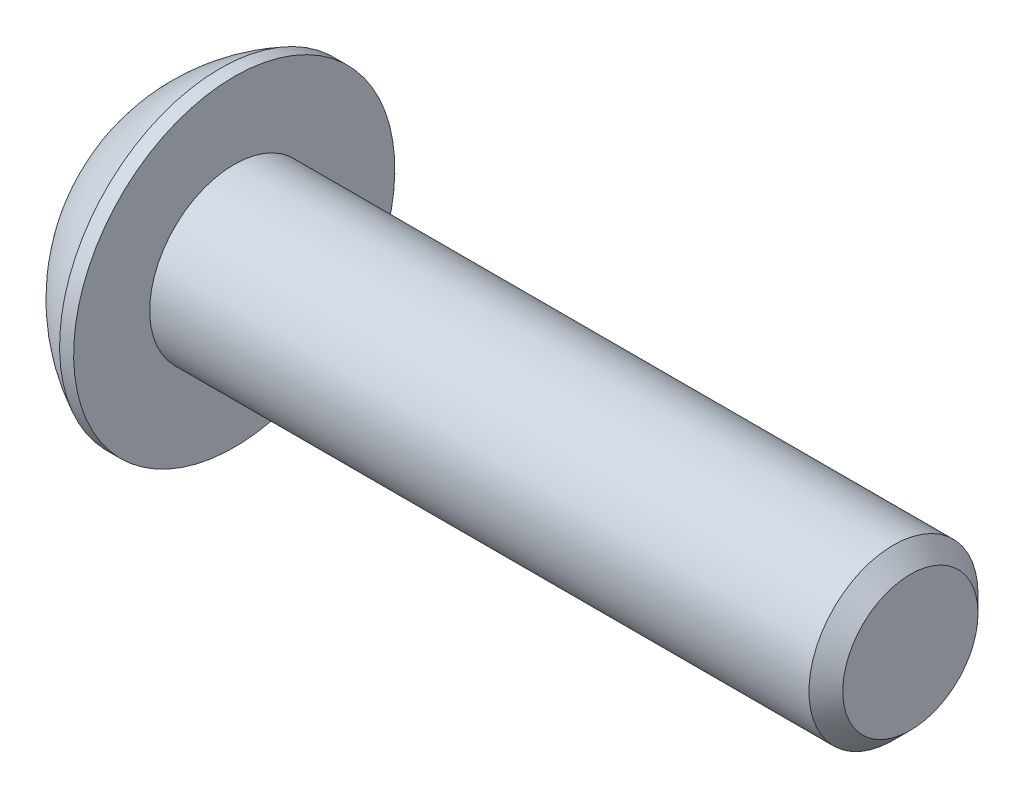
ISO-10303-21;
HEADER;
FILE_DESCRIPTION(('STEP AP214'),'2;1');
FILE_NAME('part.step','',(''),(''),'','','');
FILE_SCHEMA(('AUTOMOTIVE_DESIGN { 1 0 10303 214 1 1 1 1 }'));
ENDSEC;
DATA;
#1=APPLICATION_CONTEXT('core data for automotive mechanical design processes');
#2=APPLICATION_PROTOCOL_DEFINITION('international standard','automotive_design',2000,#1);
#3=PRODUCT_CONTEXT('',#1,'mechanical');
#4=PRODUCT('Part','Part','',(#3));
#5=PRODUCT_RELATED_PRODUCT_CATEGORY('part','',(#4));
#6=PRODUCT_DEFINITION_FORMATION('','',#4);
#7=PRODUCT_DEFINITION_CONTEXT('part definition',#1,'design');
#8=PRODUCT_DEFINITION('design','',#6,#7);
#9=PRODUCT_DEFINITION_SHAPE('','',#8);
#10=(LENGTH_UNIT() NAMED_UNIT(*) SI_UNIT(.MILLI.,.METRE.));
#11=(NAMED_UNIT(*) PLANE_ANGLE_UNIT() SI_UNIT($,.RADIAN.));
#12=(NAMED_UNIT(*) SI_UNIT($,.STERADIAN.) SOLID_ANGLE_UNIT());
#13=UNCERTAINTY_MEASURE_WITH_UNIT(LENGTH_MEASURE(1.E-05),#10,'distance_accuracy_value','');
#14=(GEOMETRIC_REPRESENTATION_CONTEXT(3) GLOBAL_UNCERTAINTY_ASSIGNED_CONTEXT((#13)) GLOBAL_UNIT_ASSIGNED_CONTEXT((#10,
#11,#12)) REPRESENTATION_CONTEXT('',''));
#15=CARTESIAN_POINT('',(0.,0.,0.));
#16=DIRECTION('',(0.,0.,1.));
#17=DIRECTION('',(1.,0.,0.));
#18=AXIS2_PLACEMENT_3D('',#15,#16,#17);
#19=CARTESIAN_POINT('',(-12.,0.,0.));
#20=DIRECTION('',(1.,0.,0.));
#21=DIRECTION('',(0.,0.,-1.));
#22=AXIS2_PLACEMENT_3D('',#19,#20,#21);
#23=CYLINDRICAL_SURFACE('',#22,1.5);
#24=CARTESIAN_POINT('',(-0.300000000000002,0.,0.));
#25=DIRECTION('',(1.,0.,0.));
#26=DIRECTION('',(0.,0.,-1.));
#27=AXIS2_PLACEMENT_3D('',#24,#25,#26);
#28=CIRCLE('',#27,1.5);
#29=CARTESIAN_POINT('',(-0.300000000000002,0.,-1.5));
#30=VERTEX_POINT('',#29);
#31=EDGE_CURVE('E45',#30,#30,#28,.F.);
#32=ORIENTED_EDGE('',*,*,#31,.T.);
#33=EDGE_LOOP('',(#32));
#34=FACE_BOUND('',#33,.T.);
#35=CARTESIAN_POINT('',(-12.,0.,0.));
#36=DIRECTION('',(1.,0.,0.));
#37=DIRECTION('',(0.,1.,0.));
#38=AXIS2_PLACEMENT_3D('',#35,#36,#37);
#39=CIRCLE('',#38,1.5);
#40=CARTESIAN_POINT('',(-12.,1.49999999999999,0.));
#41=VERTEX_POINT('',#40);
#42=EDGE_CURVE('E124',#41,#41,#39,.F.);
#43=ORIENTED_EDGE('',*,*,#42,.F.);
#44=EDGE_LOOP('',(#43));
#45=FACE_BOUND('',#44,.T.);
#46=ADVANCED_FACE('F32',(#34,#45),#23,.T.);
#47=CARTESIAN_POINT('',(0.,0.,0.));
#48=DIRECTION('',(1.,0.,0.));
#49=DIRECTION('',(0.,0.,-1.));
#50=AXIS2_PLACEMENT_3D('',#47,#48,#49);
#51=PLANE('',#50);
#52=CARTESIAN_POINT('',(0.,0.,0.));
#53=DIRECTION('',(1.,0.,0.));
#54=DIRECTION('',(0.,0.,-1.));
#55=AXIS2_PLACEMENT_3D('',#52,#53,#54);
#56=CIRCLE('',#55,1.2);
#57=CARTESIAN_POINT('',(0.,0.,-1.2));
#58=VERTEX_POINT('',#57);
#59=EDGE_CURVE('E127',#58,#58,#56,.T.);
#60=ORIENTED_EDGE('',*,*,#59,.T.);
#61=EDGE_LOOP('',(#60));
#62=FACE_BOUND('',#61,.T.);
#63=ADVANCED_FACE('F137',(#62),#51,.T.);
#64=CARTESIAN_POINT('',(0.,0.,0.));
#65=DIRECTION('',(-1.,0.,0.));
#66=DIRECTION('',(0.,0.,1.));
#67=AXIS2_PLACEMENT_3D('',#64,#65,#66);
#68=CONICAL_SURFACE('',#67,1.2,0.785398163397447);
#69=ORIENTED_EDGE('',*,*,#31,.F.);
#70=EDGE_LOOP('',(#69));
#71=FACE_BOUND('',#70,.T.);
#72=ORIENTED_EDGE('',*,*,#59,.F.);
#73=EDGE_LOOP('',(#72));
#74=FACE_BOUND('',#73,.T.);
#75=ADVANCED_FACE('F34',(#71,#74),#68,.T.);
#76=CARTESIAN_POINT('',(-13.65,0.,0.));
#77=DIRECTION('',(-1.,0.,0.));
#78=DIRECTION('',(0.,-1.,0.));
#79=AXIS2_PLACEMENT_3D('',#76,#77,#78);
#80=PLANE('',#79);
#81=CARTESIAN_POINT('',(-13.65,0.,0.));
#82=DIRECTION('',(-1.,0.,0.));
#83=DIRECTION('',(0.,-1.,0.));
#84=AXIS2_PLACEMENT_3D('',#81,#82,#83);
#85=CIRCLE('',#84,1.20470053837925);
#86=CARTESIAN_POINT('',(-13.65,-1.20470053837926,0.));
#87=VERTEX_POINT('',#86);
#88=EDGE_CURVE('E241',#87,#87,#85,.T.);
#89=ORIENTED_EDGE('',*,*,#88,.F.);
#90=EDGE_LOOP('',(#89));
#91=FACE_BOUND('',#90,.T.);
#92=CARTESIAN_POINT('',(-13.65,0.,0.));
#93=DIRECTION('',(1.,0.,0.));
#94=DIRECTION('',(0.,1.,0.));
#95=AXIS2_PLACEMENT_3D('',#92,#93,#94);
#96=CIRCLE('',#95,1.5);
#97=CARTESIAN_POINT('',(-13.65,1.5,0.));
#98=VERTEX_POINT('',#97);
#99=EDGE_CURVE('E121',#98,#98,#96,.T.);
#100=ORIENTED_EDGE('',*,*,#99,.F.);
#101=EDGE_LOOP('',(#100));
#102=FACE_BOUND('',#101,.T.);
#103=ADVANCED_FACE('F136',(#91,#102),#80,.T.);
#104=CARTESIAN_POINT('',(-10.8526785714286,0.,0.));
#105=DIRECTION('',(1.,0.,0.));
#106=DIRECTION('',(0.,1.,0.));
#107=AXIS2_PLACEMENT_3D('',#104,#105,#106);
#108=SPHERICAL_SURFACE('',#107,3.17411517981703);
#109=ORIENTED_EDGE('',*,*,#99,.T.);
#110=EDGE_LOOP('',(#109));
#111=FACE_BOUND('',#110,.T.);
#112=CARTESIAN_POINT('',(-12.25,0.,0.));
#113=DIRECTION('',(1.,0.,0.));
#114=DIRECTION('',(0.,1.,0.));
#115=AXIS2_PLACEMENT_3D('',#112,#113,#114);
#116=CIRCLE('',#115,2.85);
#117=CARTESIAN_POINT('',(-12.25,2.85,0.));
#118=VERTEX_POINT('',#117);
#119=EDGE_CURVE('E118',#118,#118,#116,.T.);
#120=ORIENTED_EDGE('',*,*,#119,.F.);
#121=EDGE_LOOP('',(#120));
#122=FACE_BOUND('',#121,.T.);
#123=ADVANCED_FACE('F148',(#111,#122),#108,.T.);
#124=CARTESIAN_POINT('',(-12.,0.,0.));
#125=DIRECTION('',(1.,0.,0.));
#126=DIRECTION('',(0.,1.,0.));
#127=AXIS2_PLACEMENT_3D('',#124,#125,#126);
#128=CYLINDRICAL_SURFACE('',#127,2.85);
#129=ORIENTED_EDGE('',*,*,#119,.T.);
#130=EDGE_LOOP('',(#129));
#131=FACE_BOUND('',#130,.T.);
#132=CARTESIAN_POINT('',(-12.,0.,0.));
#133=DIRECTION('',(1.,0.,0.));
#134=DIRECTION('',(0.,1.,0.));
#135=AXIS2_PLACEMENT_3D('',#132,#133,#134);
#136=CIRCLE('',#135,2.85);
#137=CARTESIAN_POINT('',(-12.,2.85,0.));
#138=VERTEX_POINT('',#137);
#139=EDGE_CURVE('E115',#138,#138,#136,.T.);
#140=ORIENTED_EDGE('',*,*,#139,.F.);
#141=EDGE_LOOP('',(#140));
#142=FACE_BOUND('',#141,.T.);
#143=ADVANCED_FACE('F152',(#131,#142),#128,.T.);
#144=CARTESIAN_POINT('',(-12.,2.85,0.));
#145=DIRECTION('',(1.,0.,0.));
#146=DIRECTION('',(0.,1.,0.));
#147=AXIS2_PLACEMENT_3D('',#144,#145,#146);
#148=PLANE('',#147);
#149=ORIENTED_EDGE('',*,*,#42,.T.);
#150=EDGE_LOOP('',(#149));
#151=FACE_BOUND('',#150,.T.);
#152=ORIENTED_EDGE('',*,*,#139,.T.);
#153=EDGE_LOOP('',(#152));
#154=FACE_BOUND('',#153,.T.);
#155=ADVANCED_FACE('F156',(#151,#154),#148,.T.);
#156=CARTESIAN_POINT('',(-13.65,0.,0.));
#157=DIRECTION('',(-1.,0.,0.));
#158=DIRECTION('',(0.,-1.,0.));
#159=AXIS2_PLACEMENT_3D('',#156,#157,#158);
#160=CONICAL_SURFACE('',#159,1.20470053837925,0.78539816339745);
#161=ORIENTED_EDGE('',*,*,#88,.T.);
#162=EDGE_LOOP('',(#161));
#163=FACE_BOUND('',#162,.T.);
#164=CARTESIAN_POINT('',(-14.0125645579163,-1.20678079288097,1.));
#165=CARTESIAN_POINT('',(-13.9901238799752,-1.17763239380938,1.));
#166=CARTESIAN_POINT('',(-13.9678867609271,-1.14832777655039,1.));
#167=CARTESIAN_POINT('',(-13.9239053230859,-1.08934073997341,1.));
#168=CARTESIAN_POINT('',(-13.902161120887,-1.05965823380996,1.));
#169=CARTESIAN_POINT('',(-13.8374858802222,-0.969511619364386,1.));
#170=CARTESIAN_POINT('',(-13.795456442765,-0.908390032886416,1.));
#171=CARTESIAN_POINT('',(-13.7124203349119,-0.77984989921404,1.));
#172=CARTESIAN_POINT('',(-13.6716484956871,-0.712278047733967,1.));
#173=CARTESIAN_POINT('',(-13.5967056855402,-0.573692441836185,1.));
#174=CARTESIAN_POINT('',(-13.5625124208036,-0.502691370033597,1.));
#175=CARTESIAN_POINT('',(-13.5206648240494,-0.396633108483675,1.));
#176=CARTESIAN_POINT('',(-13.5087524246011,-0.363265114723103,1.));
#177=CARTESIAN_POINT('',(-13.4876010580815,-0.295675144863699,1.));
#178=CARTESIAN_POINT('',(-13.4783622608543,-0.261453114661039,1.));
#179=CARTESIAN_POINT('',(-13.4632108375931,-0.192964714439433,1.));
#180=CARTESIAN_POINT('',(-13.4572372079353,-0.158712062702438,1.));
#181=CARTESIAN_POINT('',(-13.4487381792859,-0.0897678989597951,1.));
#182=CARTESIAN_POINT('',(-13.4462131691607,-0.0550763379077967,1.));
#183=CARTESIAN_POINT('',(-13.4448308242394,0.0128534343371955,1.));
#184=CARTESIAN_POINT('',(-13.4458171333425,0.0460884918414608,1.));
#185=CARTESIAN_POINT('',(-13.4510428296463,0.112288777523348,1.));
#186=CARTESIAN_POINT('',(-13.4552814228284,0.145254069576921,1.));
#187=CARTESIAN_POINT('',(-13.4668431932388,0.211252641710467,1.));
#188=CARTESIAN_POINT('',(-13.4742213991969,0.24427612610641,1.));
#189=CARTESIAN_POINT('',(-13.4916537633013,0.3095934161789,1.));
#190=CARTESIAN_POINT('',(-13.5017077720937,0.34188726247213,1.));
#191=CARTESIAN_POINT('',(-13.5364692676108,0.441188556116708,1.));
#192=CARTESIAN_POINT('',(-13.5650343603337,0.50684148084348,1.));
#193=CARTESIAN_POINT('',(-13.6286033694253,0.635081389212367,1.));
#194=CARTESIAN_POINT('',(-13.663629955309,0.697656564069526,1.));
#195=CARTESIAN_POINT('',(-13.7359546107891,0.817274369694615,1.));
#196=CARTESIAN_POINT('',(-13.7730556162911,0.874437672313584,1.));
#197=CARTESIAN_POINT('',(-13.8304371678966,0.958655710303487,1.));
#198=CARTESIAN_POINT('',(-13.8497720189249,0.986366163766953,1.));
#199=CARTESIAN_POINT('',(-13.8889602713879,1.04140691974409,1.));
#200=CARTESIAN_POINT('',(-13.908813529201,1.06873732439881,1.));
#201=CARTESIAN_POINT('',(-13.92888195229,1.0959092145887,1.));
#202=B_SPLINE_CURVE_WITH_KNOTS('',3,(#164,#165,#166,#167,#168,#169,#170,#171,#172,#173,#174,
#175,#176,#177,#178,#179,#180,#181,#182,#183,#184,#185,#186,#187,#188,#189,#190,#191,#192,#193,
#194,#195,#196,#197,#198,#199,#200,#201),.UNSPECIFIED.,.F.,.F.,(4,2,2,2,2,2,2,2,2,2,2,2,2,2,2,2,
2,2,4),(0.,0.110355487284534,0.220736811203826,0.443178348562911,0.679759335181117,
0.915523888816462,1.02172703810024,1.1279369325962,1.23208803653002,1.33625088357217,
1.43583459192535,1.53539399546241,1.63677534642524,1.73815103982916,1.95232008261278,
2.16725532249797,2.37159620059983,2.47295962852456,2.57429526618464),.UNSPECIFIED.);
#203=CARTESIAN_POINT('',(-13.6,-0.577350269189637,1.));
#204=VERTEX_POINT('',#203);
#205=CARTESIAN_POINT('',(-13.6,0.577350269189616,1.));
#206=VERTEX_POINT('',#205);
#207=EDGE_CURVE('E99',#204,#206,#202,.T.);
#208=ORIENTED_EDGE('',*,*,#207,.F.);
#209=CARTESIAN_POINT('',(-13.6001154873726,-1.1548160084331,-0.000200000000000086));
#210=CARTESIAN_POINT('',(-13.5802779308257,-1.13496520795027,0.0341825950071807));
#211=CARTESIAN_POINT('',(-13.5616050206389,-1.11478247255943,0.0691401181398248));
#212=CARTESIAN_POINT('',(-13.5274147427232,-1.0736273952922,0.140422802956089));
#213=CARTESIAN_POINT('',(-13.5119164090235,-1.05265113558081,0.176754750528984));
#214=CARTESIAN_POINT('',(-13.4853673071423,-1.01035337909804,0.250016613803311));
#215=CARTESIAN_POINT('',(-13.4742497739969,-0.989042666109251,0.286927851445414));
#216=CARTESIAN_POINT('',(-13.4571198657762,-0.945952199282702,0.361562729310858));
#217=CARTESIAN_POINT('',(-13.4510946974667,-0.924173762626608,0.399284088108635));
#218=CARTESIAN_POINT('',(-13.4456605549675,-0.886641312640026,0.464292198417932));
#219=CARTESIAN_POINT('',(-13.4448569383167,-0.870936130672287,0.491494371528171));
#220=CARTESIAN_POINT('',(-13.4462066994169,-0.83955617986286,0.545846040669111));
#221=CARTESIAN_POINT('',(-13.4483607295472,-0.823881418494935,0.572995523754874));
#222=CARTESIAN_POINT('',(-13.4591169721285,-0.777080970599378,0.654056277326959));
#223=CARTESIAN_POINT('',(-13.4720145564154,-0.746188191116442,0.707564140978426));
#224=CARTESIAN_POINT('',(-13.5031407306022,-0.691968116419661,0.80147606514343));
#225=CARTESIAN_POINT('',(-13.5197377977018,-0.668386557293383,0.842320523671833));
#226=CARTESIAN_POINT('',(-13.5571249246853,-0.622147085933693,0.922409637381943));
#227=CARTESIAN_POINT('',(-13.5779013418174,-0.599486449584586,0.961659010870437));
#228=CARTESIAN_POINT('',(-13.6001154873726,-0.577234799135799,1.0002));
#229=B_SPLINE_CURVE_WITH_KNOTS('',3,(#209,#210,#211,#212,#213,#214,#215,#216,#217,#218,#219,
#220,#221,#222,#223,#224,#225,#226,#227,#228),.UNSPECIFIED.,.F.,.F.,(4,2,2,2,2,2,2,2,2,4),(0.,
0.133237676828559,0.26725222983449,0.3991370762693,0.530689603280767,0.624814864263845,
0.718960890149131,0.907306626112096,1.05710100361789,1.20641411519286),.UNSPECIFIED.);
#230=CARTESIAN_POINT('',(-13.6,-1.15470053837926,0.));
#231=VERTEX_POINT('',#230);
#232=EDGE_CURVE('E198',#231,#204,#229,.T.);
#233=ORIENTED_EDGE('',*,*,#232,.F.);
#234=CARTESIAN_POINT('',(-13.6001154873726,-0.577234799135799,-1.0002));
#235=CARTESIAN_POINT('',(-13.5802779308257,-0.597085599618632,-0.965817404992819));
#236=CARTESIAN_POINT('',(-13.5616050206389,-0.617268335009467,-0.930859881860175));
#237=CARTESIAN_POINT('',(-13.5274147427232,-0.658423412276697,-0.85957719704391));
#238=CARTESIAN_POINT('',(-13.5119164090235,-0.679399671988091,-0.823245249471016));
#239=CARTESIAN_POINT('',(-13.4853673071423,-0.721697428470857,-0.749983386196689));
#240=CARTESIAN_POINT('',(-13.4742497739969,-0.743008141459647,-0.713072148554586));
#241=CARTESIAN_POINT('',(-13.4571198657762,-0.786098608286197,-0.638437270689141));
#242=CARTESIAN_POINT('',(-13.4510946974667,-0.807877044942291,-0.600715911891365));
#243=CARTESIAN_POINT('',(-13.4456605549675,-0.845409494928873,-0.535707801582067));
#244=CARTESIAN_POINT('',(-13.4448569383167,-0.861114676896612,-0.508505628471829));
#245=CARTESIAN_POINT('',(-13.4462066994169,-0.892494627706039,-0.454153959330889));
#246=CARTESIAN_POINT('',(-13.4483607295472,-0.908169389073964,-0.427004476245125));
#247=CARTESIAN_POINT('',(-13.4591169721285,-0.954969836969521,-0.345943722673041));
#248=CARTESIAN_POINT('',(-13.4720145564154,-0.985862616452458,-0.292435859021573));
#249=CARTESIAN_POINT('',(-13.5031407306022,-1.04008269114924,-0.198523934856569));
#250=CARTESIAN_POINT('',(-13.5197377977018,-1.06366425027552,-0.157679476328167));
#251=CARTESIAN_POINT('',(-13.5571249246853,-1.10990372163521,-0.0775903626180571));
#252=CARTESIAN_POINT('',(-13.5779013418174,-1.13256435798431,-0.0383409891295628));
#253=CARTESIAN_POINT('',(-13.6001154873726,-1.1548160084331,0.00019999999999995));
#254=B_SPLINE_CURVE_WITH_KNOTS('',3,(#234,#235,#236,#237,#238,#239,#240,#241,#242,#243,#244,
#245,#246,#247,#248,#249,#250,#251,#252,#253),.UNSPECIFIED.,.F.,.F.,(4,2,2,2,2,2,2,2,2,4),(0.,
0.133237676828559,0.26725222983449,0.3991370762693,0.530689603280767,0.624814864263845,
0.718960890149132,0.907306626112096,1.05710100361789,1.20641411519286),.UNSPECIFIED.);
#255=CARTESIAN_POINT('',(-13.6,-0.577350269189637,-1.));
#256=VERTEX_POINT('',#255);
#257=EDGE_CURVE('E193',#256,#231,#254,.T.);
#258=ORIENTED_EDGE('',*,*,#257,.F.);
#259=CARTESIAN_POINT('',(-14.0125645579163,-1.20678079288097,-1.));
#260=CARTESIAN_POINT('',(-13.9901238799752,-1.17763239380938,-1.));
#261=CARTESIAN_POINT('',(-13.9678867609271,-1.14832777655039,-1.));
#262=CARTESIAN_POINT('',(-13.9239053230859,-1.08934073997341,-1.));
#263=CARTESIAN_POINT('',(-13.902161120887,-1.05965823380996,-1.));
#264=CARTESIAN_POINT('',(-13.8374858802222,-0.969511619364386,-1.));
#265=CARTESIAN_POINT('',(-13.795456442765,-0.908390032886415,-1.));
#266=CARTESIAN_POINT('',(-13.7124203349119,-0.77984989921404,-1.));
#267=CARTESIAN_POINT('',(-13.6716484956871,-0.712278047733968,-1.));
#268=CARTESIAN_POINT('',(-13.5967056855402,-0.573692441836185,-1.));
#269=CARTESIAN_POINT('',(-13.5625124208036,-0.502691370033597,-1.));
#270=CARTESIAN_POINT('',(-13.5206648240494,-0.396633108483675,-1.));
#271=CARTESIAN_POINT('',(-13.5087524246011,-0.363265114723103,-1.));
#272=CARTESIAN_POINT('',(-13.4876010580815,-0.2956751448637,-1.));
#273=CARTESIAN_POINT('',(-13.4783622608543,-0.261453114661039,-1.));
#274=CARTESIAN_POINT('',(-13.4632108375931,-0.192964714439433,-1.));
#275=CARTESIAN_POINT('',(-13.4572372079353,-0.158712062702438,-1.));
#276=CARTESIAN_POINT('',(-13.4487381792859,-0.0897678989597955,-1.));
#277=CARTESIAN_POINT('',(-13.4462131691607,-0.0550763379077972,-1.));
#278=CARTESIAN_POINT('',(-13.4448308242394,0.012853434337195,-1.));
#279=CARTESIAN_POINT('',(-13.4458171333425,0.0460884918414604,-1.));
#280=CARTESIAN_POINT('',(-13.4510428296463,0.112288777523348,-1.));
#281=CARTESIAN_POINT('',(-13.4552814228284,0.145254069576921,-1.));
#282=CARTESIAN_POINT('',(-13.4668431932388,0.211252641710467,-1.));
#283=CARTESIAN_POINT('',(-13.4742213991969,0.244276126106411,-1.));
#284=CARTESIAN_POINT('',(-13.4916537633013,0.3095934161789,-1.));
#285=CARTESIAN_POINT('',(-13.5017077720937,0.34188726247213,-1.));
#286=CARTESIAN_POINT('',(-13.5364692676108,0.441188556116708,-1.));
#287=CARTESIAN_POINT('',(-13.5650343603337,0.50684148084348,-1.));
#288=CARTESIAN_POINT('',(-13.6286033694253,0.635081389212366,-1.));
#289=CARTESIAN_POINT('',(-13.663629955309,0.697656564069526,-1.));
#290=CARTESIAN_POINT('',(-13.7359546107891,0.817274369694615,-1.));
#291=CARTESIAN_POINT('',(-13.7730556162911,0.874437672313584,-1.));
#292=CARTESIAN_POINT('',(-13.8304371678966,0.958655710303487,-1.));
#293=CARTESIAN_POINT('',(-13.8497720189249,0.986366163766954,-1.));
#294=CARTESIAN_POINT('',(-13.8889602713879,1.04140691974409,-1.));
#295=CARTESIAN_POINT('',(-13.908813529201,1.06873732439881,-1.));
#296=CARTESIAN_POINT('',(-13.92888195229,1.0959092145887,-1.));
#297=B_SPLINE_CURVE_WITH_KNOTS('',3,(#259,#260,#261,#262,#263,#264,#265,#266,#267,#268,#269,
#270,#271,#272,#273,#274,#275,#276,#277,#278,#279,#280,#281,#282,#283,#284,#285,#286,#287,#288,
#289,#290,#291,#292,#293,#294,#295,#296),.UNSPECIFIED.,.F.,.F.,(4,2,2,2,2,2,2,2,2,2,2,2,2,2,2,2,
2,2,4),(0.,0.110355487284534,0.220736811203825,0.443178348562911,0.679759335181115,
0.915523888816463,1.02172703810024,1.1279369325962,1.23208803653002,1.33625088357217,
1.43583459192535,1.53539399546241,1.63677534642524,1.73815103982916,1.95232008261278,
2.16725532249797,2.37159620059983,2.47295962852456,2.57429526618464),.UNSPECIFIED.);
#298=CARTESIAN_POINT('',(-13.6,0.577350269189616,-1.));
#299=VERTEX_POINT('',#298);
#300=EDGE_CURVE('E52',#299,#256,#297,.F.);
#301=ORIENTED_EDGE('',*,*,#300,.F.);
#302=CARTESIAN_POINT('',(-13.6001154873726,1.15481600843308,0.000199999999999967));
#303=CARTESIAN_POINT('',(-13.5802779308257,1.13496520795025,-0.0341825950071809));
#304=CARTESIAN_POINT('',(-13.5616050206389,1.11478247255941,-0.0691401181398252));
#305=CARTESIAN_POINT('',(-13.5274147427232,1.07362739529218,-0.14042280295609));
#306=CARTESIAN_POINT('',(-13.5119164090235,1.05265113558079,-0.176754750528985));
#307=CARTESIAN_POINT('',(-13.4853673071423,1.01035337909802,-0.250016613803312));
#308=CARTESIAN_POINT('',(-13.4742497739969,0.98904266610923,-0.286927851445416));
#309=CARTESIAN_POINT('',(-13.4571198657762,0.94595219928268,-0.361562729310861));
#310=CARTESIAN_POINT('',(-13.4510946974667,0.924173762626585,-0.399284088108638));
#311=CARTESIAN_POINT('',(-13.4456605549675,0.886641312640003,-0.464292198417936));
#312=CARTESIAN_POINT('',(-13.4448569383167,0.870936130672264,-0.491494371528174));
#313=CARTESIAN_POINT('',(-13.4462066994169,0.839556179862837,-0.545846040669114));
#314=CARTESIAN_POINT('',(-13.4483607295472,0.823881418494912,-0.572995523754878));
#315=CARTESIAN_POINT('',(-13.4591169721285,0.777080970599355,-0.654056277326962));
#316=CARTESIAN_POINT('',(-13.4720145564154,0.746188191116419,-0.70756414097843));
#317=CARTESIAN_POINT('',(-13.5031407306022,0.691968116419638,-0.801476065143433));
#318=CARTESIAN_POINT('',(-13.5197377977018,0.66838655729336,-0.842320523671836));
#319=CARTESIAN_POINT('',(-13.5571249246853,0.622147085933671,-0.922409637381944));
#320=CARTESIAN_POINT('',(-13.5779013418174,0.599486449584565,-0.961659010870438));
#321=CARTESIAN_POINT('',(-13.6001154873726,0.577234799135778,-1.0002));
#322=B_SPLINE_CURVE_WITH_KNOTS('',3,(#302,#303,#304,#305,#306,#307,#308,#309,#310,#311,#312,
#313,#314,#315,#316,#317,#318,#319,#320,#321),.UNSPECIFIED.,.F.,.F.,(4,2,2,2,2,2,2,2,2,4),(0.,
0.133237676828559,0.267252229834491,0.399137076269301,0.53068960328077,0.624814864263848,
0.718960890149135,0.9073066261121,1.05710100361789,1.20641411519286),.UNSPECIFIED.);
#323=CARTESIAN_POINT('',(-13.6,1.15470053837924,0.));
#324=VERTEX_POINT('',#323);
#325=EDGE_CURVE('E11',#324,#299,#322,.T.);
#326=ORIENTED_EDGE('',*,*,#325,.F.);
#327=CARTESIAN_POINT('',(-13.6001154873726,0.577234799135778,1.0002));
#328=CARTESIAN_POINT('',(-13.5802779308257,0.597085599618611,0.965817404992819));
#329=CARTESIAN_POINT('',(-13.5616050206389,0.617268335009446,0.930859881860175));
#330=CARTESIAN_POINT('',(-13.5274147427232,0.658423412276675,0.859577197043911));
#331=CARTESIAN_POINT('',(-13.5119164090235,0.679399671988069,0.823245249471017));
#332=CARTESIAN_POINT('',(-13.4853673071423,0.721697428470835,0.74998338619669));
#333=CARTESIAN_POINT('',(-13.4742497739969,0.743008141459626,0.713072148554587));
#334=CARTESIAN_POINT('',(-13.4571198657762,0.786098608286175,0.638437270689142));
#335=CARTESIAN_POINT('',(-13.4510946974667,0.80787704494227,0.600715911891365));
#336=CARTESIAN_POINT('',(-13.4456605549675,0.845409494928852,0.535707801582068));
#337=CARTESIAN_POINT('',(-13.4448569383167,0.861114676896591,0.508505628471829));
#338=CARTESIAN_POINT('',(-13.4462066994169,0.892494627706018,0.454153959330889));
#339=CARTESIAN_POINT('',(-13.4483607295472,0.908169389073943,0.427004476245126));
#340=CARTESIAN_POINT('',(-13.4591169721285,0.9549698369695,0.345943722673041));
#341=CARTESIAN_POINT('',(-13.4720145564154,0.985862616452436,0.292435859021574));
#342=CARTESIAN_POINT('',(-13.5031407306022,1.04008269114922,0.19852393485657));
#343=CARTESIAN_POINT('',(-13.5197377977018,1.06366425027549,0.157679476328167));
#344=CARTESIAN_POINT('',(-13.5571249246853,1.10990372163519,0.0775903626180574));
#345=CARTESIAN_POINT('',(-13.5779013418174,1.13256435798429,0.0383409891295631));
#346=CARTESIAN_POINT('',(-13.6001154873726,1.15481600843308,-0.000199999999999691));
#347=B_SPLINE_CURVE_WITH_KNOTS('',3,(#327,#328,#329,#330,#331,#332,#333,#334,#335,#336,#337,
#338,#339,#340,#341,#342,#343,#344,#345,#346),.UNSPECIFIED.,.F.,.F.,(4,2,2,2,2,2,2,2,2,4),(0.,
0.133237676828558,0.267252229834489,0.399137076269298,0.530689603280766,0.624814864263844,
0.718960890149131,0.907306626112095,1.05710100361789,1.20641411519286),.UNSPECIFIED.);
#348=EDGE_CURVE('E90',#206,#324,#347,.T.);
#349=ORIENTED_EDGE('',*,*,#348,.F.);
#350=EDGE_LOOP('',(#208,#233,#258,#301,#326,#349));
#351=FACE_BOUND('',#350,.T.);
#352=ADVANCED_FACE('F89',(#163,#351),#160,.F.);
#353=CARTESIAN_POINT('',(-12.45,0.,0.));
#354=DIRECTION('',(-1.,0.,0.));
#355=DIRECTION('',(0.,0.,1.));
#356=AXIS2_PLACEMENT_3D('',#353,#354,#355);
#357=PLANE('',#356);
#358=DIRECTION('',(0.,0.5,-0.866025403784439));
#359=VECTOR('',#358,1.);
#360=CARTESIAN_POINT('',(-12.45,0.577350269189616,1.));
#361=LINE('',#360,#359);
#362=CARTESIAN_POINT('',(-12.45,0.577350269189616,1.));
#363=VERTEX_POINT('',#362);
#364=CARTESIAN_POINT('',(-12.45,1.15470053837924,0.));
#365=VERTEX_POINT('',#364);
#366=EDGE_CURVE('E98',#363,#365,#361,.T.);
#367=ORIENTED_EDGE('',*,*,#366,.T.);
#368=DIRECTION('',(0.,-0.5,-0.866025403784439));
#369=VECTOR('',#368,1.);
#370=CARTESIAN_POINT('',(-12.45,1.15470053837924,0.));
#371=LINE('',#370,#369);
#372=CARTESIAN_POINT('',(-12.45,0.577350269189615,-1.));
#373=VERTEX_POINT('',#372);
#374=EDGE_CURVE('E103',#365,#373,#371,.T.);
#375=ORIENTED_EDGE('',*,*,#374,.T.);
#376=DIRECTION('',(0.,-1.,0.));
#377=VECTOR('',#376,1.);
#378=CARTESIAN_POINT('',(-12.45,0.577350269189615,-1.));
#379=LINE('',#378,#377);
#380=CARTESIAN_POINT('',(-12.45,-0.577350269189637,-1.));
#381=VERTEX_POINT('',#380);
#382=EDGE_CURVE('E223',#373,#381,#379,.T.);
#383=ORIENTED_EDGE('',*,*,#382,.T.);
#384=DIRECTION('',(0.,-0.5,0.866025403784439));
#385=VECTOR('',#384,1.);
#386=CARTESIAN_POINT('',(-12.45,-0.577350269189637,-1.));
#387=LINE('',#386,#385);
#388=CARTESIAN_POINT('',(-12.45,-1.15470053837926,0.));
#389=VERTEX_POINT('',#388);
#390=EDGE_CURVE('E227',#381,#389,#387,.T.);
#391=ORIENTED_EDGE('',*,*,#390,.T.);
#392=DIRECTION('',(0.,0.5,0.866025403784439));
#393=VECTOR('',#392,1.);
#394=CARTESIAN_POINT('',(-12.45,-1.15470053837926,0.));
#395=LINE('',#394,#393);
#396=CARTESIAN_POINT('',(-12.45,-0.577350269189637,1.));
#397=VERTEX_POINT('',#396);
#398=EDGE_CURVE('E111',#389,#397,#395,.T.);
#399=ORIENTED_EDGE('',*,*,#398,.T.);
#400=DIRECTION('',(0.,1.,0.));
#401=VECTOR('',#400,1.);
#402=CARTESIAN_POINT('',(-12.45,-0.577350269189637,1.));
#403=LINE('',#402,#401);
#404=EDGE_CURVE('E106',#397,#363,#403,.T.);
#405=ORIENTED_EDGE('',*,*,#404,.T.);
#406=EDGE_LOOP('',(#367,#375,#383,#391,#399,#405));
#407=FACE_BOUND('',#406,.T.);
#408=ADVANCED_FACE('F180',(#407),#357,.T.);
#409=CARTESIAN_POINT('',(-12.45,1.15470053837924,0.));
#410=DIRECTION('',(0.,0.866025403784439,-0.5));
#411=DIRECTION('',(0.,0.5,0.866025403784439));
#412=AXIS2_PLACEMENT_3D('',#409,#410,#411);
#413=PLANE('',#412);
#414=DIRECTION('',(-1.,0.,0.));
#415=VECTOR('',#414,1.);
#416=CARTESIAN_POINT('',(-12.45,1.15470053837924,0.));
#417=LINE('',#416,#415);
#418=EDGE_CURVE('E96',#365,#324,#417,.T.);
#419=ORIENTED_EDGE('',*,*,#418,.T.);
#420=ORIENTED_EDGE('',*,*,#325,.T.);
#421=DIRECTION('',(-1.,0.,0.));
#422=VECTOR('',#421,1.);
#423=CARTESIAN_POINT('',(-12.45,0.577350269189615,-1.));
#424=LINE('',#423,#422);
#425=EDGE_CURVE('E105',#373,#299,#424,.T.);
#426=ORIENTED_EDGE('',*,*,#425,.F.);
#427=ORIENTED_EDGE('',*,*,#374,.F.);
#428=EDGE_LOOP('',(#419,#420,#426,#427));
#429=FACE_BOUND('',#428,.T.);
#430=ADVANCED_FACE('F101',(#429),#413,.F.);
#431=CARTESIAN_POINT('',(-12.45,0.577350269189615,-1.));
#432=DIRECTION('',(0.,0.,-1.));
#433=DIRECTION('',(-1.,0.,0.));
#434=AXIS2_PLACEMENT_3D('',#431,#432,#433);
#435=PLANE('',#434);
#436=ORIENTED_EDGE('',*,*,#425,.T.);
#437=ORIENTED_EDGE('',*,*,#300,.T.);
#438=DIRECTION('',(-1.,0.,0.));
#439=VECTOR('',#438,1.);
#440=CARTESIAN_POINT('',(-12.45,-0.577350269189637,-1.));
#441=LINE('',#440,#439);
#442=EDGE_CURVE('E108',#381,#256,#441,.T.);
#443=ORIENTED_EDGE('',*,*,#442,.F.);
#444=ORIENTED_EDGE('',*,*,#382,.F.);
#445=EDGE_LOOP('',(#436,#437,#443,#444));
#446=FACE_BOUND('',#445,.T.);
#447=ADVANCED_FACE('F212',(#446),#435,.F.);
#448=CARTESIAN_POINT('',(-12.45,-0.577350269189637,-1.));
#449=DIRECTION('',(0.,-0.866025403784439,-0.5));
#450=DIRECTION('',(0.,0.5,-0.866025403784439));
#451=AXIS2_PLACEMENT_3D('',#448,#449,#450);
#452=PLANE('',#451);
#453=ORIENTED_EDGE('',*,*,#442,.T.);
#454=ORIENTED_EDGE('',*,*,#257,.T.);
#455=DIRECTION('',(-1.,0.,0.));
#456=VECTOR('',#455,1.);
#457=CARTESIAN_POINT('',(-12.45,-1.15470053837926,0.));
#458=LINE('',#457,#456);
#459=EDGE_CURVE('E237',#389,#231,#458,.T.);
#460=ORIENTED_EDGE('',*,*,#459,.F.);
#461=ORIENTED_EDGE('',*,*,#390,.F.);
#462=EDGE_LOOP('',(#453,#454,#460,#461));
#463=FACE_BOUND('',#462,.T.);
#464=ADVANCED_FACE('F207',(#463),#452,.F.);
#465=CARTESIAN_POINT('',(-12.45,-1.15470053837926,0.));
#466=DIRECTION('',(0.,-0.866025403784439,0.5));
#467=DIRECTION('',(0.,-0.5,-0.866025403784439));
#468=AXIS2_PLACEMENT_3D('',#465,#466,#467);
#469=PLANE('',#468);
#470=ORIENTED_EDGE('',*,*,#459,.T.);
#471=ORIENTED_EDGE('',*,*,#232,.T.);
#472=DIRECTION('',(-1.,0.,0.));
#473=VECTOR('',#472,1.);
#474=CARTESIAN_POINT('',(-12.45,-0.577350269189637,1.));
#475=LINE('',#474,#473);
#476=EDGE_CURVE('E234',#397,#204,#475,.T.);
#477=ORIENTED_EDGE('',*,*,#476,.F.);
#478=ORIENTED_EDGE('',*,*,#398,.F.);
#479=EDGE_LOOP('',(#470,#471,#477,#478));
#480=FACE_BOUND('',#479,.T.);
#481=ADVANCED_FACE('F204',(#480),#469,.F.);
#482=CARTESIAN_POINT('',(-12.45,-0.577350269189637,1.));
#483=DIRECTION('',(0.,0.,1.));
#484=DIRECTION('',(1.,0.,0.));
#485=AXIS2_PLACEMENT_3D('',#482,#483,#484);
#486=PLANE('',#485);
#487=ORIENTED_EDGE('',*,*,#476,.T.);
#488=ORIENTED_EDGE('',*,*,#207,.T.);
#489=DIRECTION('',(-1.,0.,0.));
#490=VECTOR('',#489,1.);
#491=CARTESIAN_POINT('',(-12.45,0.577350269189616,1.));
#492=LINE('',#491,#490);
#493=EDGE_CURVE('E59',#363,#206,#492,.T.);
#494=ORIENTED_EDGE('',*,*,#493,.F.);
#495=ORIENTED_EDGE('',*,*,#404,.F.);
#496=EDGE_LOOP('',(#487,#488,#494,#495));
#497=FACE_BOUND('',#496,.T.);
#498=ADVANCED_FACE('F163',(#497),#486,.F.);
#499=CARTESIAN_POINT('',(-12.45,0.577350269189616,1.));
#500=DIRECTION('',(0.,0.866025403784439,0.5));
#501=DIRECTION('',(0.,-0.5,0.866025403784439));
#502=AXIS2_PLACEMENT_3D('',#499,#500,#501);
#503=PLANE('',#502);
#504=ORIENTED_EDGE('',*,*,#493,.T.);
#505=ORIENTED_EDGE('',*,*,#348,.T.);
#506=ORIENTED_EDGE('',*,*,#418,.F.);
#507=ORIENTED_EDGE('',*,*,#366,.F.);
#508=EDGE_LOOP('',(#504,#505,#506,#507));
#509=FACE_BOUND('',#508,.T.);
#510=ADVANCED_FACE('F95',(#509),#503,.F.);
#511=CLOSED_SHELL('',(#46,#63,#75,#103,#123,#143,#155,#352,#408,#430,#447,#464,#481,#498,#510));
#512=MANIFOLD_SOLID_BREP('B2',#511);
#513=ADVANCED_BREP_SHAPE_REPRESENTATION('',(#18,#512),#14);
#514=SHAPE_DEFINITION_REPRESENTATION(#9,#513);
ENDSEC;
END-ISO-10303-21;
